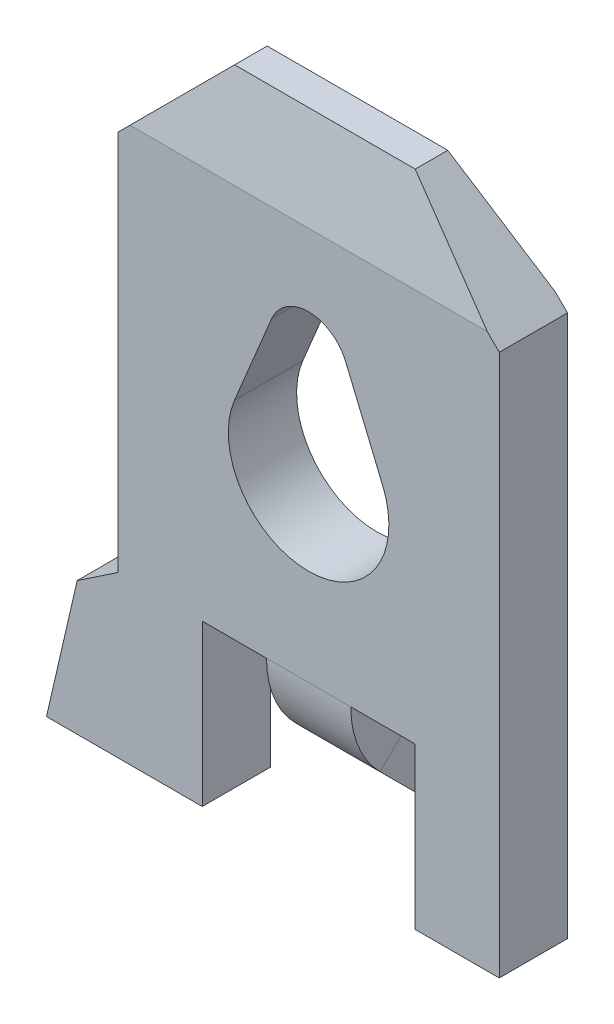
ISO-10303-21;
HEADER;
FILE_DESCRIPTION(('STEP AP214'),'2;1');
FILE_NAME('part.step','',(''),(''),'','','');
FILE_SCHEMA(('AUTOMOTIVE_DESIGN { 1 0 10303 214 1 1 1 1 }'));
ENDSEC;
DATA;
#1=APPLICATION_CONTEXT('core data for automotive mechanical design processes');
#2=APPLICATION_PROTOCOL_DEFINITION('international standard','automotive_design',2000,#1);
#3=PRODUCT_CONTEXT('',#1,'mechanical');
#4=PRODUCT('Part','Part','',(#3));
#5=PRODUCT_RELATED_PRODUCT_CATEGORY('part','',(#4));
#6=PRODUCT_DEFINITION_FORMATION('','',#4);
#7=PRODUCT_DEFINITION_CONTEXT('part definition',#1,'design');
#8=PRODUCT_DEFINITION('design','',#6,#7);
#9=PRODUCT_DEFINITION_SHAPE('','',#8);
#10=(LENGTH_UNIT() NAMED_UNIT(*) SI_UNIT(.MILLI.,.METRE.));
#11=(NAMED_UNIT(*) PLANE_ANGLE_UNIT() SI_UNIT($,.RADIAN.));
#12=(NAMED_UNIT(*) SI_UNIT($,.STERADIAN.) SOLID_ANGLE_UNIT());
#13=UNCERTAINTY_MEASURE_WITH_UNIT(LENGTH_MEASURE(1.E-05),#10,'distance_accuracy_value','');
#14=(GEOMETRIC_REPRESENTATION_CONTEXT(3) GLOBAL_UNCERTAINTY_ASSIGNED_CONTEXT((#13)) GLOBAL_UNIT_ASSIGNED_CONTEXT((#10,
#11,#12)) REPRESENTATION_CONTEXT('',''));
#15=CARTESIAN_POINT('',(0.,0.,0.));
#16=DIRECTION('',(0.,0.,1.));
#17=DIRECTION('',(1.,0.,0.));
#18=AXIS2_PLACEMENT_3D('',#15,#16,#17);
#19=CARTESIAN_POINT('',(4.75,0.149999999999999,0.));
#20=DIRECTION('',(0.,0.,1.));
#21=DIRECTION('',(0.,-1.,0.));
#22=AXIS2_PLACEMENT_3D('',#19,#20,#21);
#23=PLANE('',#22);
#24=DIRECTION('',(0.384813689288075,-0.922994271128755,0.));
#25=VECTOR('',#24,1.);
#26=CARTESIAN_POINT('',(2.84243697464802,5.82748992853653,0.));
#27=LINE('',#26,#25);
#28=CARTESIAN_POINT('',(2.84243697464802,5.82748992853653,0.));
#29=VERTEX_POINT('',#28);
#30=CARTESIAN_POINT('',(3.29799427112875,4.73481368928808,0.));
#31=VERTEX_POINT('',#30);
#32=EDGE_CURVE('E310',#29,#31,#27,.T.);
#33=ORIENTED_EDGE('',*,*,#32,.F.);
#34=CARTESIAN_POINT('',(2.375,5.65,0.));
#35=DIRECTION('',(0.,0.,1.));
#36=DIRECTION('',(0.,-1.,0.));
#37=AXIS2_PLACEMENT_3D('',#34,#35,#36);
#38=CIRCLE('',#37,0.5);
#39=CARTESIAN_POINT('',(1.91346153846154,5.84230769230769,0.));
#40=VERTEX_POINT('',#39);
#41=EDGE_CURVE('E313',#40,#29,#38,.F.);
#42=ORIENTED_EDGE('',*,*,#41,.F.);
#43=DIRECTION('',(0.384615384615385,0.923076923076923,0.));
#44=VECTOR('',#43,1.);
#45=CARTESIAN_POINT('',(1.91346153846154,5.84230769230769,0.));
#46=LINE('',#45,#44);
#47=CARTESIAN_POINT('',(1.45192307692308,4.73461538461538,0.));
#48=VERTEX_POINT('',#47);
#49=EDGE_CURVE('E315',#48,#40,#46,.T.);
#50=ORIENTED_EDGE('',*,*,#49,.F.);
#51=CARTESIAN_POINT('',(2.375,4.35,0.));
#52=DIRECTION('',(0.,0.,1.));
#53=DIRECTION('',(0.,-1.,0.));
#54=AXIS2_PLACEMENT_3D('',#51,#52,#53);
#55=CIRCLE('',#54,0.999999999999999);
#56=EDGE_CURVE('E307',#31,#48,#55,.F.);
#57=ORIENTED_EDGE('',*,*,#56,.F.);
#58=EDGE_LOOP('',(#33,#42,#50,#57));
#59=FACE_BOUND('',#58,.T.);
#60=DIRECTION('',(1.,0.,0.));
#61=VECTOR('',#60,1.);
#62=CARTESIAN_POINT('',(2.9,2.15,0.));
#63=LINE('',#62,#61);
#64=CARTESIAN_POINT('',(2.9,2.15,0.));
#65=VERTEX_POINT('',#64);
#66=CARTESIAN_POINT('',(3.7,2.15,0.));
#67=VERTEX_POINT('',#66);
#68=EDGE_CURVE('E274',#65,#67,#63,.T.);
#69=ORIENTED_EDGE('',*,*,#68,.F.);
#70=DIRECTION('',(-1.,0.,0.));
#71=VECTOR('',#70,1.);
#72=CARTESIAN_POINT('',(4.75,2.15,0.));
#73=LINE('',#72,#71);
#74=CARTESIAN_POINT('',(1.85,2.15,0.));
#75=VERTEX_POINT('',#74);
#76=EDGE_CURVE('E49',#65,#75,#73,.T.);
#77=ORIENTED_EDGE('',*,*,#76,.T.);
#78=DIRECTION('',(1.,0.,0.));
#79=VECTOR('',#78,1.);
#80=CARTESIAN_POINT('',(1.85,2.15,0.));
#81=LINE('',#80,#79);
#82=CARTESIAN_POINT('',(1.05,2.15,0.));
#83=VERTEX_POINT('',#82);
#84=EDGE_CURVE('E285',#83,#75,#81,.T.);
#85=ORIENTED_EDGE('',*,*,#84,.F.);
#86=DIRECTION('',(0.,1.,0.));
#87=VECTOR('',#86,1.);
#88=CARTESIAN_POINT('',(1.05,2.15,0.));
#89=LINE('',#88,#87);
#90=CARTESIAN_POINT('',(1.05,0.149999999999999,0.));
#91=VERTEX_POINT('',#90);
#92=EDGE_CURVE('E282',#91,#83,#89,.T.);
#93=ORIENTED_EDGE('',*,*,#92,.F.);
#94=DIRECTION('',(-1.,0.,0.));
#95=VECTOR('',#94,1.);
#96=CARTESIAN_POINT('',(4.75,0.149999999999999,0.));
#97=LINE('',#96,#95);
#98=CARTESIAN_POINT('',(-0.890356386047537,0.149999999999998,0.));
#99=VERTEX_POINT('',#98);
#100=EDGE_CURVE('E379',#91,#99,#97,.T.);
#101=ORIENTED_EDGE('',*,*,#100,.T.);
#102=DIRECTION('',(0.224692209858573,0.974429787531596,0.));
#103=VECTOR('',#102,1.);
#104=CARTESIAN_POINT('',(-0.507898340442458,1.80861785930754,0.));
#105=LINE('',#104,#103);
#106=CARTESIAN_POINT('',(-0.507898340442458,1.80861785930754,0.));
#107=VERTEX_POINT('',#106);
#108=EDGE_CURVE('E228',#99,#107,#105,.T.);
#109=ORIENTED_EDGE('',*,*,#108,.T.);
#110=DIRECTION('',(0.829945240760083,0.557844868525011,0.));
#111=VECTOR('',#110,1.);
#112=CARTESIAN_POINT('',(0.,2.15,0.));
#113=LINE('',#112,#111);
#114=CARTESIAN_POINT('',(0.,2.15,0.));
#115=VERTEX_POINT('',#114);
#116=EDGE_CURVE('E206',#107,#115,#113,.T.);
#117=ORIENTED_EDGE('',*,*,#116,.T.);
#118=DIRECTION('',(0.,1.,0.));
#119=VECTOR('',#118,1.);
#120=CARTESIAN_POINT('',(0.,0.149999999999999,0.));
#121=LINE('',#120,#119);
#122=CARTESIAN_POINT('',(0.,6.9,0.));
#123=VERTEX_POINT('',#122);
#124=EDGE_CURVE('E369',#115,#123,#121,.T.);
#125=ORIENTED_EDGE('',*,*,#124,.T.);
#126=DIRECTION('',(-0.707106781186548,-0.707106781186548,0.));
#127=VECTOR('',#126,1.);
#128=CARTESIAN_POINT('',(0.,6.9,0.));
#129=LINE('',#128,#127);
#130=CARTESIAN_POINT('',(0.15,7.05,0.));
#131=VERTEX_POINT('',#130);
#132=EDGE_CURVE('E343',#131,#123,#129,.T.);
#133=ORIENTED_EDGE('',*,*,#132,.F.);
#134=DIRECTION('',(-1.,0.,0.));
#135=VECTOR('',#134,1.);
#136=CARTESIAN_POINT('',(4.75,7.05,0.));
#137=LINE('',#136,#135);
#138=CARTESIAN_POINT('',(4.6,7.05,0.));
#139=VERTEX_POINT('',#138);
#140=EDGE_CURVE('E374',#139,#131,#137,.T.);
#141=ORIENTED_EDGE('',*,*,#140,.F.);
#142=DIRECTION('',(-0.707106781186548,0.707106781186548,0.));
#143=VECTOR('',#142,1.);
#144=CARTESIAN_POINT('',(3.5,8.15,0.));
#145=LINE('',#144,#143);
#146=CARTESIAN_POINT('',(4.75,6.9,0.));
#147=VERTEX_POINT('',#146);
#148=EDGE_CURVE('E339',#147,#139,#145,.T.);
#149=ORIENTED_EDGE('',*,*,#148,.F.);
#150=DIRECTION('',(0.,1.,0.));
#151=VECTOR('',#150,1.);
#152=CARTESIAN_POINT('',(4.75,0.149999999999999,0.));
#153=LINE('',#152,#151);
#154=CARTESIAN_POINT('',(4.75,0.149999999999999,0.));
#155=VERTEX_POINT('',#154);
#156=EDGE_CURVE('E371',#155,#147,#153,.T.);
#157=ORIENTED_EDGE('',*,*,#156,.F.);
#158=CARTESIAN_POINT('',(3.7,0.149999999999999,0.));
#159=VERTEX_POINT('',#158);
#160=EDGE_CURVE('E380',#155,#159,#97,.T.);
#161=ORIENTED_EDGE('',*,*,#160,.T.);
#162=DIRECTION('',(0.,-1.,0.));
#163=VECTOR('',#162,1.);
#164=CARTESIAN_POINT('',(3.7,2.15,0.));
#165=LINE('',#164,#163);
#166=EDGE_CURVE('E299',#67,#159,#165,.T.);
#167=ORIENTED_EDGE('',*,*,#166,.F.);
#168=EDGE_LOOP('',(#69,#77,#85,#93,#101,#109,#117,#125,#133,#141,#149,#157,#161,#167));
#169=FACE_BOUND('',#168,.T.);
#170=ADVANCED_FACE('F42',(#59,#169),#23,.F.);
#171=CARTESIAN_POINT('',(4.75,7.05,0.85));
#172=DIRECTION('',(0.,0.,-1.));
#173=DIRECTION('',(0.,1.,0.));
#174=AXIS2_PLACEMENT_3D('',#171,#172,#173);
#175=PLANE('',#174);
#176=DIRECTION('',(-0.384615384615385,-0.923076923076923,0.));
#177=VECTOR('',#176,1.);
#178=CARTESIAN_POINT('',(1.91346153846154,5.84230769230769,0.849999999999999));
#179=LINE('',#178,#177);
#180=CARTESIAN_POINT('',(1.91346153846154,5.84230769230769,0.85));
#181=VERTEX_POINT('',#180);
#182=CARTESIAN_POINT('',(1.45192307692308,4.73461538461538,0.849999999999999));
#183=VERTEX_POINT('',#182);
#184=EDGE_CURVE('E317',#181,#183,#179,.T.);
#185=ORIENTED_EDGE('',*,*,#184,.F.);
#186=CARTESIAN_POINT('',(2.375,5.65,0.849999999999999));
#187=DIRECTION('',(0.,0.,1.));
#188=DIRECTION('',(1.,0.,0.));
#189=AXIS2_PLACEMENT_3D('',#186,#187,#188);
#190=CIRCLE('',#189,0.5);
#191=CARTESIAN_POINT('',(2.84243697464802,5.82748992853653,0.849999999999999));
#192=VERTEX_POINT('',#191);
#193=EDGE_CURVE('E293',#192,#181,#190,.T.);
#194=ORIENTED_EDGE('',*,*,#193,.F.);
#195=DIRECTION('',(-0.384813689288075,0.922994271128755,0.));
#196=VECTOR('',#195,1.);
#197=CARTESIAN_POINT('',(2.84243697464802,5.82748992853653,0.849999999999999));
#198=LINE('',#197,#196);
#199=CARTESIAN_POINT('',(3.29799427112875,4.73481368928808,0.849999999999999));
#200=VERTEX_POINT('',#199);
#201=EDGE_CURVE('E323',#200,#192,#198,.T.);
#202=ORIENTED_EDGE('',*,*,#201,.F.);
#203=CARTESIAN_POINT('',(2.375,4.35,0.849999999999999));
#204=DIRECTION('',(0.,0.,1.));
#205=DIRECTION('',(1.,0.,0.));
#206=AXIS2_PLACEMENT_3D('',#203,#204,#205);
#207=CIRCLE('',#206,0.999999999999999);
#208=EDGE_CURVE('E320',#183,#200,#207,.T.);
#209=ORIENTED_EDGE('',*,*,#208,.F.);
#210=EDGE_LOOP('',(#185,#194,#202,#209));
#211=FACE_BOUND('',#210,.T.);
#212=DIRECTION('',(-1.,0.,0.));
#213=VECTOR('',#212,1.);
#214=CARTESIAN_POINT('',(1.85,2.15,0.85));
#215=LINE('',#214,#213);
#216=CARTESIAN_POINT('',(1.85,2.15,0.85));
#217=VERTEX_POINT('',#216);
#218=CARTESIAN_POINT('',(1.05,2.15,0.85));
#219=VERTEX_POINT('',#218);
#220=EDGE_CURVE('E278',#217,#219,#215,.T.);
#221=ORIENTED_EDGE('',*,*,#220,.F.);
#222=DIRECTION('',(1.,0.,0.));
#223=VECTOR('',#222,1.);
#224=CARTESIAN_POINT('',(4.75,2.15,0.849999999999999));
#225=LINE('',#224,#223);
#226=CARTESIAN_POINT('',(2.9,2.15,0.849999999999999));
#227=VERTEX_POINT('',#226);
#228=EDGE_CURVE('E396',#217,#227,#225,.T.);
#229=ORIENTED_EDGE('',*,*,#228,.T.);
#230=DIRECTION('',(-1.,0.,0.));
#231=VECTOR('',#230,1.);
#232=CARTESIAN_POINT('',(2.9,2.15,0.85));
#233=LINE('',#232,#231);
#234=CARTESIAN_POINT('',(3.7,2.15,0.85));
#235=VERTEX_POINT('',#234);
#236=EDGE_CURVE('E286',#235,#227,#233,.T.);
#237=ORIENTED_EDGE('',*,*,#236,.F.);
#238=DIRECTION('',(0.,1.,0.));
#239=VECTOR('',#238,1.);
#240=CARTESIAN_POINT('',(3.7,2.15,0.85));
#241=LINE('',#240,#239);
#242=CARTESIAN_POINT('',(3.7,0.149999999999999,0.849999999999999));
#243=VERTEX_POINT('',#242);
#244=EDGE_CURVE('E294',#243,#235,#241,.T.);
#245=ORIENTED_EDGE('',*,*,#244,.F.);
#246=DIRECTION('',(-1.,0.,0.));
#247=VECTOR('',#246,1.);
#248=CARTESIAN_POINT('',(4.75,0.149999999999999,0.849999999999999));
#249=LINE('',#248,#247);
#250=CARTESIAN_POINT('',(4.75,0.149999999999999,0.849999999999999));
#251=VERTEX_POINT('',#250);
#252=EDGE_CURVE('E384',#251,#243,#249,.T.);
#253=ORIENTED_EDGE('',*,*,#252,.F.);
#254=DIRECTION('',(0.,-1.,0.));
#255=VECTOR('',#254,1.);
#256=CARTESIAN_POINT('',(4.75,7.05,0.85));
#257=LINE('',#256,#255);
#258=CARTESIAN_POINT('',(4.75,6.9,0.85));
#259=VERTEX_POINT('',#258);
#260=EDGE_CURVE('E366',#259,#251,#257,.T.);
#261=ORIENTED_EDGE('',*,*,#260,.F.);
#262=DIRECTION('',(0.707106781186548,-0.707106781186548,0.));
#263=VECTOR('',#262,1.);
#264=CARTESIAN_POINT('',(3.5,8.15,0.849999999999999));
#265=LINE('',#264,#263);
#266=CARTESIAN_POINT('',(4.6,7.05,0.849999999999999));
#267=VERTEX_POINT('',#266);
#268=EDGE_CURVE('E335',#267,#259,#265,.T.);
#269=ORIENTED_EDGE('',*,*,#268,.F.);
#270=DIRECTION('',(-1.,0.,0.));
#271=VECTOR('',#270,1.);
#272=CARTESIAN_POINT('',(4.75,7.05,0.85));
#273=LINE('',#272,#271);
#274=CARTESIAN_POINT('',(0.15,7.05,0.849999999999999));
#275=VERTEX_POINT('',#274);
#276=EDGE_CURVE('E387',#267,#275,#273,.T.);
#277=ORIENTED_EDGE('',*,*,#276,.T.);
#278=DIRECTION('',(0.707106781186547,0.707106781186548,0.));
#279=VECTOR('',#278,1.);
#280=CARTESIAN_POINT('',(0.,6.9,0.849999999999999));
#281=LINE('',#280,#279);
#282=CARTESIAN_POINT('',(0.,6.9,0.849999999999999));
#283=VERTEX_POINT('',#282);
#284=EDGE_CURVE('E336',#283,#275,#281,.T.);
#285=ORIENTED_EDGE('',*,*,#284,.F.);
#286=DIRECTION('',(0.,-1.,0.));
#287=VECTOR('',#286,1.);
#288=CARTESIAN_POINT('',(0.,7.05,0.85));
#289=LINE('',#288,#287);
#290=CARTESIAN_POINT('',(0.,2.15,0.849999999999999));
#291=VERTEX_POINT('',#290);
#292=EDGE_CURVE('E225',#283,#291,#289,.T.);
#293=ORIENTED_EDGE('',*,*,#292,.T.);
#294=DIRECTION('',(-0.829945240760083,-0.557844868525011,0.));
#295=VECTOR('',#294,1.);
#296=CARTESIAN_POINT('',(0.,2.15,0.849999999999999));
#297=LINE('',#296,#295);
#298=CARTESIAN_POINT('',(-0.507898340442458,1.80861785930754,0.849999999999999));
#299=VERTEX_POINT('',#298);
#300=EDGE_CURVE('E56',#291,#299,#297,.T.);
#301=ORIENTED_EDGE('',*,*,#300,.T.);
#302=DIRECTION('',(-0.224692209858573,-0.974429787531596,0.));
#303=VECTOR('',#302,1.);
#304=CARTESIAN_POINT('',(-0.507898340442458,1.80861785930754,0.849999999999999));
#305=LINE('',#304,#303);
#306=CARTESIAN_POINT('',(-0.890356386047537,0.149999999999998,0.849999999999999));
#307=VERTEX_POINT('',#306);
#308=EDGE_CURVE('E214',#299,#307,#305,.T.);
#309=ORIENTED_EDGE('',*,*,#308,.T.);
#310=CARTESIAN_POINT('',(1.05,0.149999999999999,0.849999999999999));
#311=VERTEX_POINT('',#310);
#312=EDGE_CURVE('E383',#311,#307,#249,.T.);
#313=ORIENTED_EDGE('',*,*,#312,.F.);
#314=DIRECTION('',(0.,-1.,0.));
#315=VECTOR('',#314,1.);
#316=CARTESIAN_POINT('',(1.05,2.15,0.85));
#317=LINE('',#316,#315);
#318=EDGE_CURVE('E280',#219,#311,#317,.T.);
#319=ORIENTED_EDGE('',*,*,#318,.F.);
#320=EDGE_LOOP('',(#221,#229,#237,#245,#253,#261,#269,#277,#285,#293,#301,#309,#313,#319));
#321=FACE_BOUND('',#320,.T.);
#322=ADVANCED_FACE('F222',(#211,#321),#175,.F.);
#323=CARTESIAN_POINT('',(4.75,0.149999999999999,0.));
#324=DIRECTION('',(0.,1.,0.));
#325=DIRECTION('',(0.,0.,1.));
#326=AXIS2_PLACEMENT_3D('',#323,#324,#325);
#327=PLANE('',#326);
#328=ORIENTED_EDGE('',*,*,#100,.F.);
#329=DIRECTION('',(0.,0.,-1.));
#330=VECTOR('',#329,1.);
#331=CARTESIAN_POINT('',(1.05,0.149999999999999,3.0040659228538));
#332=LINE('',#331,#330);
#333=EDGE_CURVE('E289',#311,#91,#332,.T.);
#334=ORIENTED_EDGE('',*,*,#333,.F.);
#335=ORIENTED_EDGE('',*,*,#312,.T.);
#336=DIRECTION('',(0.,0.,1.));
#337=VECTOR('',#336,1.);
#338=CARTESIAN_POINT('',(-0.890356386047537,0.149999999999998,-2.18923148483107));
#339=LINE('',#338,#337);
#340=EDGE_CURVE('E209',#99,#307,#339,.T.);
#341=ORIENTED_EDGE('',*,*,#340,.F.);
#342=EDGE_LOOP('',(#328,#334,#335,#341));
#343=FACE_BOUND('',#342,.T.);
#344=ADVANCED_FACE('F454',(#343),#327,.F.);
#345=CARTESIAN_POINT('',(4.75,7.05,0.));
#346=DIRECTION('',(0.,-0.214348018272916,0.976757353216485));
#347=DIRECTION('',(0.,-0.976757353216485,-0.214348018272916));
#348=AXIS2_PLACEMENT_3D('',#345,#346,#347);
#349=PLANE('',#348);
#350=ORIENTED_EDGE('',*,*,#140,.T.);
#351=DIRECTION('',(0.698744344369524,0.698744344369524,0.153338457091523));
#352=VECTOR('',#351,1.);
#353=CARTESIAN_POINT('',(2.39592083042662,9.29592083042662,0.492864146468432));
#354=LINE('',#353,#352);
#355=CARTESIAN_POINT('',(1.25,8.15,0.241393442622949));
#356=VERTEX_POINT('',#355);
#357=EDGE_CURVE('E357',#131,#356,#354,.T.);
#358=ORIENTED_EDGE('',*,*,#357,.T.);
#359=DIRECTION('',(-1.,0.,0.));
#360=VECTOR('',#359,1.);
#361=CARTESIAN_POINT('',(4.75,8.15,0.241393442622949));
#362=LINE('',#361,#360);
#363=CARTESIAN_POINT('',(3.5,8.15,0.241393442622949));
#364=VERTEX_POINT('',#363);
#365=EDGE_CURVE('E393',#364,#356,#362,.T.);
#366=ORIENTED_EDGE('',*,*,#365,.F.);
#367=DIRECTION('',(0.698744344369524,-0.698744344369524,-0.153338457091523));
#368=VECTOR('',#367,1.);
#369=CARTESIAN_POINT('',(4.67323654881826,6.97676345118174,-0.0160716569500576));
#370=LINE('',#369,#368);
#371=EDGE_CURVE('E363',#364,#139,#370,.T.);
#372=ORIENTED_EDGE('',*,*,#371,.T.);
#373=EDGE_LOOP('',(#350,#358,#366,#372));
#374=FACE_BOUND('',#373,.T.);
#375=ADVANCED_FACE('F516',(#374),#349,.F.);
#376=CARTESIAN_POINT('',(4.75,8.15,0.241393442622949));
#377=DIRECTION('',(0.,-1.,0.));
#378=DIRECTION('',(0.,0.,-1.));
#379=AXIS2_PLACEMENT_3D('',#376,#377,#378);
#380=PLANE('',#379);
#381=ORIENTED_EDGE('',*,*,#365,.T.);
#382=DIRECTION('',(0.,0.,1.));
#383=VECTOR('',#382,1.);
#384=CARTESIAN_POINT('',(1.25,8.15,-1.76776695296637));
#385=LINE('',#384,#383);
#386=CARTESIAN_POINT('',(1.25,8.15,0.647131147540979));
#387=VERTEX_POINT('',#386);
#388=EDGE_CURVE('E340',#356,#387,#385,.T.);
#389=ORIENTED_EDGE('',*,*,#388,.T.);
#390=DIRECTION('',(-1.,0.,0.));
#391=VECTOR('',#390,1.);
#392=CARTESIAN_POINT('',(4.75,8.15,0.647131147540979));
#393=LINE('',#392,#391);
#394=CARTESIAN_POINT('',(3.5,8.15,0.647131147540979));
#395=VERTEX_POINT('',#394);
#396=EDGE_CURVE('E390',#395,#387,#393,.T.);
#397=ORIENTED_EDGE('',*,*,#396,.F.);
#398=DIRECTION('',(0.,0.,1.));
#399=VECTOR('',#398,1.);
#400=CARTESIAN_POINT('',(3.5,8.15,-1.76776695296637));
#401=LINE('',#400,#399);
#402=EDGE_CURVE('E349',#364,#395,#401,.T.);
#403=ORIENTED_EDGE('',*,*,#402,.F.);
#404=EDGE_LOOP('',(#381,#389,#397,#403));
#405=FACE_BOUND('',#404,.T.);
#406=ADVANCED_FACE('F512',(#405),#380,.F.);
#407=CARTESIAN_POINT('',(4.75,8.15,0.647131147540979));
#408=DIRECTION('',(0.,-0.181367589437408,-0.983415373838371));
#409=DIRECTION('',(0.,0.983415373838371,-0.181367589437408));
#410=AXIS2_PLACEMENT_3D('',#407,#408,#409);
#411=PLANE('',#410);
#412=ORIENTED_EDGE('',*,*,#396,.T.);
#413=DIRECTION('',(-0.70116968993079,-0.70116968993079,0.12931408215937));
#414=VECTOR('',#413,1.);
#415=CARTESIAN_POINT('',(2.97073626927174,9.87073626927174,0.329782245421185));
#416=LINE('',#415,#414);
#417=EDGE_CURVE('E347',#387,#275,#416,.T.);
#418=ORIENTED_EDGE('',*,*,#417,.T.);
#419=ORIENTED_EDGE('',*,*,#276,.F.);
#420=DIRECTION('',(-0.70116968993079,0.70116968993079,-0.12931408215937));
#421=VECTOR('',#420,1.);
#422=CARTESIAN_POINT('',(4.11454866759705,7.53545133240295,0.760470041155192));
#423=LINE('',#422,#421);
#424=EDGE_CURVE('E360',#267,#395,#423,.T.);
#425=ORIENTED_EDGE('',*,*,#424,.T.);
#426=EDGE_LOOP('',(#412,#418,#419,#425));
#427=FACE_BOUND('',#426,.T.);
#428=ADVANCED_FACE('F508',(#427),#411,.F.);
#429=ORIENTED_EDGE('',*,*,#252,.T.);
#430=DIRECTION('',(0.,0.,-1.));
#431=VECTOR('',#430,1.);
#432=CARTESIAN_POINT('',(3.7,0.149999999999999,3.0040659228538));
#433=LINE('',#432,#431);
#434=EDGE_CURVE('E296',#243,#159,#433,.T.);
#435=ORIENTED_EDGE('',*,*,#434,.T.);
#436=ORIENTED_EDGE('',*,*,#160,.F.);
#437=DIRECTION('',(0.,0.,-1.));
#438=VECTOR('',#437,1.);
#439=CARTESIAN_POINT('',(4.75,0.149999999999999,0.));
#440=LINE('',#439,#438);
#441=EDGE_CURVE('E368',#251,#155,#440,.T.);
#442=ORIENTED_EDGE('',*,*,#441,.F.);
#443=EDGE_LOOP('',(#429,#435,#436,#442));
#444=FACE_BOUND('',#443,.T.);
#445=ADVANCED_FACE('F501',(#444),#327,.F.);
#446=CARTESIAN_POINT('',(4.75,0.,0.));
#447=DIRECTION('',(1.,0.,0.));
#448=DIRECTION('',(0.,0.,-1.));
#449=AXIS2_PLACEMENT_3D('',#446,#447,#448);
#450=PLANE('',#449);
#451=DIRECTION('',(0.,0.,1.));
#452=VECTOR('',#451,1.);
#453=CARTESIAN_POINT('',(4.75,6.9,-1.76776695296637));
#454=LINE('',#453,#452);
#455=EDGE_CURVE('E350',#147,#259,#454,.T.);
#456=ORIENTED_EDGE('',*,*,#455,.T.);
#457=ORIENTED_EDGE('',*,*,#260,.T.);
#458=ORIENTED_EDGE('',*,*,#441,.T.);
#459=ORIENTED_EDGE('',*,*,#156,.T.);
#460=EDGE_LOOP('',(#456,#457,#458,#459));
#461=FACE_BOUND('',#460,.T.);
#462=ADVANCED_FACE('F498',(#461),#450,.T.);
#463=CARTESIAN_POINT('',(0.,0.,0.));
#464=DIRECTION('',(1.,0.,0.));
#465=DIRECTION('',(0.,0.,-1.));
#466=AXIS2_PLACEMENT_3D('',#463,#464,#465);
#467=PLANE('',#466);
#468=ORIENTED_EDGE('',*,*,#124,.F.);
#469=DIRECTION('',(0.,0.,1.));
#470=VECTOR('',#469,1.);
#471=CARTESIAN_POINT('',(0.,2.15,-2.18923148483107));
#472=LINE('',#471,#470);
#473=EDGE_CURVE('E210',#115,#291,#472,.T.);
#474=ORIENTED_EDGE('',*,*,#473,.T.);
#475=ORIENTED_EDGE('',*,*,#292,.F.);
#476=DIRECTION('',(0.,0.,1.));
#477=VECTOR('',#476,1.);
#478=CARTESIAN_POINT('',(0.,6.9,-1.76776695296637));
#479=LINE('',#478,#477);
#480=EDGE_CURVE('E338',#123,#283,#479,.T.);
#481=ORIENTED_EDGE('',*,*,#480,.F.);
#482=EDGE_LOOP('',(#468,#474,#475,#481));
#483=FACE_BOUND('',#482,.T.);
#484=ADVANCED_FACE('F493',(#483),#467,.F.);
#485=CARTESIAN_POINT('',(0.,6.9,-1.76776695296637));
#486=DIRECTION('',(0.707106781186548,-0.707106781186548,0.));
#487=DIRECTION('',(0.707106781186548,0.707106781186548,0.));
#488=AXIS2_PLACEMENT_3D('',#485,#486,#487);
#489=PLANE('',#488);
#490=ORIENTED_EDGE('',*,*,#132,.T.);
#491=ORIENTED_EDGE('',*,*,#480,.T.);
#492=ORIENTED_EDGE('',*,*,#284,.T.);
#493=ORIENTED_EDGE('',*,*,#417,.F.);
#494=ORIENTED_EDGE('',*,*,#388,.F.);
#495=ORIENTED_EDGE('',*,*,#357,.F.);
#496=EDGE_LOOP('',(#490,#491,#492,#493,#494,#495));
#497=FACE_BOUND('',#496,.T.);
#498=ADVANCED_FACE('F490',(#497),#489,.F.);
#499=CARTESIAN_POINT('',(3.5,8.15,-1.76776695296637));
#500=DIRECTION('',(-0.707106781186547,-0.707106781186547,0.));
#501=DIRECTION('',(0.707106781186548,-0.707106781186548,0.));
#502=AXIS2_PLACEMENT_3D('',#499,#500,#501);
#503=PLANE('',#502);
#504=ORIENTED_EDGE('',*,*,#402,.T.);
#505=ORIENTED_EDGE('',*,*,#424,.F.);
#506=ORIENTED_EDGE('',*,*,#268,.T.);
#507=ORIENTED_EDGE('',*,*,#455,.F.);
#508=ORIENTED_EDGE('',*,*,#148,.T.);
#509=ORIENTED_EDGE('',*,*,#371,.F.);
#510=EDGE_LOOP('',(#504,#505,#506,#507,#508,#509));
#511=FACE_BOUND('',#510,.T.);
#512=ADVANCED_FACE('F489',(#511),#503,.F.);
#513=CARTESIAN_POINT('',(2.375,5.65,-3.44093010681705));
#514=DIRECTION('',(0.,0.,1.));
#515=DIRECTION('',(1.,0.,0.));
#516=AXIS2_PLACEMENT_3D('',#513,#514,#515);
#517=CYLINDRICAL_SURFACE('',#516,0.5);
#518=ORIENTED_EDGE('',*,*,#41,.T.);
#519=DIRECTION('',(0.,0.,1.));
#520=VECTOR('',#519,1.);
#521=CARTESIAN_POINT('',(2.84243697464802,5.82748992853653,-3.44093010681705));
#522=LINE('',#521,#520);
#523=EDGE_CURVE('E311',#29,#192,#522,.T.);
#524=ORIENTED_EDGE('',*,*,#523,.T.);
#525=ORIENTED_EDGE('',*,*,#193,.T.);
#526=DIRECTION('',(0.,0.,1.));
#527=VECTOR('',#526,1.);
#528=CARTESIAN_POINT('',(1.91346153846154,5.84230769230769,-3.44093010681705));
#529=LINE('',#528,#527);
#530=EDGE_CURVE('E326',#40,#181,#529,.T.);
#531=ORIENTED_EDGE('',*,*,#530,.F.);
#532=EDGE_LOOP('',(#518,#524,#525,#531));
#533=FACE_BOUND('',#532,.T.);
#534=ADVANCED_FACE('F472',(#533),#517,.F.);
#535=CARTESIAN_POINT('',(2.84243697464802,5.82748992853653,-3.44093010681705));
#536=DIRECTION('',(0.922994271128755,0.384813689288075,0.));
#537=DIRECTION('',(-0.384813689288075,0.922994271128755,0.));
#538=AXIS2_PLACEMENT_3D('',#535,#536,#537);
#539=PLANE('',#538);
#540=ORIENTED_EDGE('',*,*,#32,.T.);
#541=DIRECTION('',(0.,0.,1.));
#542=VECTOR('',#541,1.);
#543=CARTESIAN_POINT('',(3.29799427112875,4.73481368928808,-3.44093010681705));
#544=LINE('',#543,#542);
#545=EDGE_CURVE('E328',#31,#200,#544,.T.);
#546=ORIENTED_EDGE('',*,*,#545,.T.);
#547=ORIENTED_EDGE('',*,*,#201,.T.);
#548=ORIENTED_EDGE('',*,*,#523,.F.);
#549=EDGE_LOOP('',(#540,#546,#547,#548));
#550=FACE_BOUND('',#549,.T.);
#551=ADVANCED_FACE('F463',(#550),#539,.F.);
#552=CARTESIAN_POINT('',(2.375,4.35,-3.44093010681705));
#553=DIRECTION('',(0.,0.,1.));
#554=DIRECTION('',(1.,0.,0.));
#555=AXIS2_PLACEMENT_3D('',#552,#553,#554);
#556=CYLINDRICAL_SURFACE('',#555,0.999999999999999);
#557=ORIENTED_EDGE('',*,*,#56,.T.);
#558=DIRECTION('',(0.,0.,1.));
#559=VECTOR('',#558,1.);
#560=CARTESIAN_POINT('',(1.45192307692308,4.73461538461538,-3.44093010681705));
#561=LINE('',#560,#559);
#562=EDGE_CURVE('E330',#48,#183,#561,.T.);
#563=ORIENTED_EDGE('',*,*,#562,.T.);
#564=ORIENTED_EDGE('',*,*,#208,.T.);
#565=ORIENTED_EDGE('',*,*,#545,.F.);
#566=EDGE_LOOP('',(#557,#563,#564,#565));
#567=FACE_BOUND('',#566,.T.);
#568=ADVANCED_FACE('F465',(#567),#556,.F.);
#569=CARTESIAN_POINT('',(1.91346153846154,5.84230769230769,-3.44093010681705));
#570=DIRECTION('',(-0.923076923076923,0.384615384615385,0.));
#571=DIRECTION('',(-0.384615384615385,-0.923076923076923,0.));
#572=AXIS2_PLACEMENT_3D('',#569,#570,#571);
#573=PLANE('',#572);
#574=ORIENTED_EDGE('',*,*,#49,.T.);
#575=ORIENTED_EDGE('',*,*,#530,.T.);
#576=ORIENTED_EDGE('',*,*,#184,.T.);
#577=ORIENTED_EDGE('',*,*,#562,.F.);
#578=EDGE_LOOP('',(#574,#575,#576,#577));
#579=FACE_BOUND('',#578,.T.);
#580=ADVANCED_FACE('F474',(#579),#573,.F.);
#581=CARTESIAN_POINT('',(3.7,2.15,3.0040659228538));
#582=DIRECTION('',(1.,0.,0.));
#583=DIRECTION('',(0.,1.,0.));
#584=AXIS2_PLACEMENT_3D('',#581,#582,#583);
#585=PLANE('',#584);
#586=ORIENTED_EDGE('',*,*,#244,.T.);
#587=DIRECTION('',(0.,0.,-1.));
#588=VECTOR('',#587,1.);
#589=CARTESIAN_POINT('',(3.7,2.15,3.0040659228538));
#590=LINE('',#589,#588);
#591=EDGE_CURVE('E301',#235,#67,#590,.T.);
#592=ORIENTED_EDGE('',*,*,#591,.T.);
#593=ORIENTED_EDGE('',*,*,#166,.T.);
#594=ORIENTED_EDGE('',*,*,#434,.F.);
#595=EDGE_LOOP('',(#586,#592,#593,#594));
#596=FACE_BOUND('',#595,.T.);
#597=ADVANCED_FACE('F476',(#596),#585,.F.);
#598=CARTESIAN_POINT('',(2.9,2.15,3.0040659228538));
#599=DIRECTION('',(0.,1.,0.));
#600=DIRECTION('',(-1.,0.,0.));
#601=AXIS2_PLACEMENT_3D('',#598,#599,#600);
#602=PLANE('',#601);
#603=ORIENTED_EDGE('',*,*,#236,.T.);
#604=DIRECTION('',(0.,0.,-1.));
#605=VECTOR('',#604,1.);
#606=CARTESIAN_POINT('',(2.9,2.15,3.0040659228538));
#607=LINE('',#606,#605);
#608=EDGE_CURVE('E12',#227,#65,#607,.T.);
#609=ORIENTED_EDGE('',*,*,#608,.T.);
#610=ORIENTED_EDGE('',*,*,#68,.T.);
#611=ORIENTED_EDGE('',*,*,#591,.F.);
#612=EDGE_LOOP('',(#603,#609,#610,#611));
#613=FACE_BOUND('',#612,.T.);
#614=ADVANCED_FACE('F407',(#613),#602,.F.);
#615=CARTESIAN_POINT('',(1.85,2.15,3.0040659228538));
#616=DIRECTION('',(0.,1.,0.));
#617=DIRECTION('',(0.,0.,1.));
#618=AXIS2_PLACEMENT_3D('',#615,#616,#617);
#619=PLANE('',#618);
#620=ORIENTED_EDGE('',*,*,#220,.T.);
#621=DIRECTION('',(0.,0.,-1.));
#622=VECTOR('',#621,1.);
#623=CARTESIAN_POINT('',(1.05,2.15,3.0040659228538));
#624=LINE('',#623,#622);
#625=EDGE_CURVE('E281',#219,#83,#624,.T.);
#626=ORIENTED_EDGE('',*,*,#625,.T.);
#627=ORIENTED_EDGE('',*,*,#84,.T.);
#628=DIRECTION('',(0.,0.,-1.));
#629=VECTOR('',#628,1.);
#630=CARTESIAN_POINT('',(1.85,2.15,3.0040659228538));
#631=LINE('',#630,#629);
#632=EDGE_CURVE('E399',#217,#75,#631,.T.);
#633=ORIENTED_EDGE('',*,*,#632,.F.);
#634=EDGE_LOOP('',(#620,#626,#627,#633));
#635=FACE_BOUND('',#634,.T.);
#636=ADVANCED_FACE('F420',(#635),#619,.F.);
#637=CARTESIAN_POINT('',(1.05,2.15,3.0040659228538));
#638=DIRECTION('',(-1.,0.,0.));
#639=DIRECTION('',(0.,-1.,0.));
#640=AXIS2_PLACEMENT_3D('',#637,#638,#639);
#641=PLANE('',#640);
#642=ORIENTED_EDGE('',*,*,#318,.T.);
#643=ORIENTED_EDGE('',*,*,#333,.T.);
#644=ORIENTED_EDGE('',*,*,#92,.T.);
#645=ORIENTED_EDGE('',*,*,#625,.F.);
#646=EDGE_LOOP('',(#642,#643,#644,#645));
#647=FACE_BOUND('',#646,.T.);
#648=ADVANCED_FACE('F542',(#647),#641,.F.);
#649=CARTESIAN_POINT('',(1.85,2.15,-0.400000000000001));
#650=DIRECTION('',(-1.,0.,0.));
#651=DIRECTION('',(0.,0.,1.));
#652=AXIS2_PLACEMENT_3D('',#649,#650,#651);
#653=PLANE('',#652);
#654=ORIENTED_EDGE('',*,*,#632,.T.);
#655=CARTESIAN_POINT('',(1.85,2.15,-0.400000000000001));
#656=DIRECTION('',(1.,0.,0.));
#657=DIRECTION('',(0.,1.,0.));
#658=AXIS2_PLACEMENT_3D('',#655,#656,#657);
#659=CIRCLE('',#658,0.4);
#660=CARTESIAN_POINT('',(1.85,1.86715728752538,-0.117157287525382));
#661=VERTEX_POINT('',#660);
#662=EDGE_CURVE('E236',#75,#661,#659,.T.);
#663=ORIENTED_EDGE('',*,*,#662,.T.);
#664=DIRECTION('',(0.,-0.707106781186554,0.707106781186541));
#665=VECTOR('',#664,1.);
#666=CARTESIAN_POINT('',(1.85,-0.257038097655978,2.00703809765595));
#667=LINE('',#666,#665);
#668=CARTESIAN_POINT('',(1.85,1.26611652351682,0.483883476483182));
#669=VERTEX_POINT('',#668);
#670=EDGE_CURVE('E256',#661,#669,#667,.T.);
#671=ORIENTED_EDGE('',*,*,#670,.T.);
#672=CARTESIAN_POINT('',(1.85,2.15,-0.400000000000001));
#673=DIRECTION('',(1.,0.,0.));
#674=DIRECTION('',(0.,0.,1.));
#675=AXIS2_PLACEMENT_3D('',#672,#673,#674);
#676=CIRCLE('',#675,1.25);
#677=EDGE_CURVE('E267',#217,#669,#676,.T.);
#678=ORIENTED_EDGE('',*,*,#677,.F.);
#679=EDGE_LOOP('',(#654,#663,#671,#678));
#680=FACE_BOUND('',#679,.T.);
#681=ADVANCED_FACE('F422',(#680),#653,.T.);
#682=CARTESIAN_POINT('',(2.9,2.15,-0.400000000000001));
#683=DIRECTION('',(1.,0.,0.));
#684=DIRECTION('',(0.,0.,-1.));
#685=AXIS2_PLACEMENT_3D('',#682,#683,#684);
#686=PLANE('',#685);
#687=DIRECTION('',(0.,0.707106781186554,-0.707106781186541));
#688=VECTOR('',#687,1.);
#689=CARTESIAN_POINT('',(2.9,-0.257038097655979,2.00703809765595));
#690=LINE('',#689,#688);
#691=CARTESIAN_POINT('',(2.9,1.26611652351682,0.483883476483185));
#692=VERTEX_POINT('',#691);
#693=CARTESIAN_POINT('',(2.9,1.86715728752538,-0.117157287525382));
#694=VERTEX_POINT('',#693);
#695=EDGE_CURVE('E262',#692,#694,#690,.T.);
#696=ORIENTED_EDGE('',*,*,#695,.T.);
#697=CARTESIAN_POINT('',(2.9,2.15,-0.400000000000001));
#698=DIRECTION('',(1.,0.,0.));
#699=DIRECTION('',(0.,1.,0.));
#700=AXIS2_PLACEMENT_3D('',#697,#698,#699);
#701=CIRCLE('',#700,0.4);
#702=EDGE_CURVE('E271',#694,#65,#701,.F.);
#703=ORIENTED_EDGE('',*,*,#702,.T.);
#704=ORIENTED_EDGE('',*,*,#608,.F.);
#705=CARTESIAN_POINT('',(2.9,2.15,-0.400000000000001));
#706=DIRECTION('',(-1.,0.,0.));
#707=DIRECTION('',(0.,0.,-1.));
#708=AXIS2_PLACEMENT_3D('',#705,#706,#707);
#709=CIRCLE('',#708,1.25);
#710=EDGE_CURVE('E270',#692,#227,#709,.T.);
#711=ORIENTED_EDGE('',*,*,#710,.F.);
#712=EDGE_LOOP('',(#696,#703,#704,#711));
#713=FACE_BOUND('',#712,.T.);
#714=ADVANCED_FACE('F411',(#713),#686,.T.);
#715=CARTESIAN_POINT('',(0.876719746353102,2.15,-0.400000000000001));
#716=DIRECTION('',(1.,0.,0.));
#717=DIRECTION('',(0.,1.,0.));
#718=AXIS2_PLACEMENT_3D('',#715,#716,#717);
#719=CYLINDRICAL_SURFACE('',#718,1.25);
#720=ORIENTED_EDGE('',*,*,#710,.T.);
#721=ORIENTED_EDGE('',*,*,#228,.F.);
#722=ORIENTED_EDGE('',*,*,#677,.T.);
#723=DIRECTION('',(1.,0.,0.));
#724=VECTOR('',#723,1.);
#725=CARTESIAN_POINT('',(4.75,1.26611652351681,0.48388347648318));
#726=LINE('',#725,#724);
#727=EDGE_CURVE('E233',#669,#692,#726,.T.);
#728=ORIENTED_EDGE('',*,*,#727,.T.);
#729=EDGE_LOOP('',(#720,#721,#722,#728));
#730=FACE_BOUND('',#729,.T.);
#731=ADVANCED_FACE('F414',(#730),#719,.T.);
#732=CARTESIAN_POINT('',(0.876719746353102,2.15,-0.400000000000001));
#733=DIRECTION('',(1.,0.,0.));
#734=DIRECTION('',(0.,1.,0.));
#735=AXIS2_PLACEMENT_3D('',#732,#733,#734);
#736=CYLINDRICAL_SURFACE('',#735,0.4);
#737=ORIENTED_EDGE('',*,*,#702,.F.);
#738=DIRECTION('',(-1.,0.,0.));
#739=VECTOR('',#738,1.);
#740=CARTESIAN_POINT('',(4.75,1.86715728752538,-0.11715728752538));
#741=LINE('',#740,#739);
#742=EDGE_CURVE('E259',#694,#661,#741,.T.);
#743=ORIENTED_EDGE('',*,*,#742,.T.);
#744=ORIENTED_EDGE('',*,*,#662,.F.);
#745=ORIENTED_EDGE('',*,*,#76,.F.);
#746=EDGE_LOOP('',(#737,#743,#744,#745));
#747=FACE_BOUND('',#746,.T.);
#748=ADVANCED_FACE('F423',(#747),#736,.F.);
#749=CARTESIAN_POINT('',(0.,0.204009246963323,-1.78030532808745));
#750=DIRECTION('',(0.,-0.707106781186546,-0.707106781186549));
#751=DIRECTION('',(0.,0.707106781186549,-0.707106781186546));
#752=AXIS2_PLACEMENT_3D('',#749,#750,#751);
#753=PLANE('',#752);
#754=DIRECTION('',(0.,-0.707106781186549,0.707106781186546));
#755=VECTOR('',#754,1.);
#756=CARTESIAN_POINT('',(2.9,0.204009246963323,-1.78030532808745));
#757=LINE('',#756,#755);
#758=CARTESIAN_POINT('',(2.9,0.204009246963323,-1.78030532808745));
#759=VERTEX_POINT('',#758);
#760=CARTESIAN_POINT('',(2.9,-0.397031517045243,-1.17926456407888));
#761=VERTEX_POINT('',#760);
#762=EDGE_CURVE('E253',#759,#761,#757,.T.);
#763=ORIENTED_EDGE('',*,*,#762,.T.);
#764=DIRECTION('',(-1.,0.,0.));
#765=VECTOR('',#764,1.);
#766=CARTESIAN_POINT('',(2.9,-0.397031517045243,-1.17926456407888));
#767=LINE('',#766,#765);
#768=CARTESIAN_POINT('',(1.85,-0.397031517045243,-1.17926456407888));
#769=VERTEX_POINT('',#768);
#770=EDGE_CURVE('E250',#761,#769,#767,.T.);
#771=ORIENTED_EDGE('',*,*,#770,.T.);
#772=DIRECTION('',(0.,0.707106781186549,-0.707106781186546));
#773=VECTOR('',#772,1.);
#774=CARTESIAN_POINT('',(1.85,-0.397031517045243,-1.17926456407888));
#775=LINE('',#774,#773);
#776=CARTESIAN_POINT('',(1.85,0.204009246963323,-1.78030532808745));
#777=VERTEX_POINT('',#776);
#778=EDGE_CURVE('E247',#769,#777,#775,.T.);
#779=ORIENTED_EDGE('',*,*,#778,.T.);
#780=DIRECTION('',(1.,0.,0.));
#781=VECTOR('',#780,1.);
#782=CARTESIAN_POINT('',(1.85,0.204009246963323,-1.78030532808745));
#783=LINE('',#782,#781);
#784=EDGE_CURVE('E244',#777,#759,#783,.T.);
#785=ORIENTED_EDGE('',*,*,#784,.T.);
#786=EDGE_LOOP('',(#763,#771,#779,#785));
#787=FACE_BOUND('',#786,.T.);
#788=ADVANCED_FACE('F438',(#787),#753,.T.);
#789=CARTESIAN_POINT('',(4.75,5.18911205432847,4.40687900729485));
#790=DIRECTION('',(0.,0.707106781186549,-0.707106781186546));
#791=DIRECTION('',(0.,0.707106781186546,0.707106781186549));
#792=AXIS2_PLACEMENT_3D('',#789,#790,#791);
#793=PLANE('',#792);
#794=ORIENTED_EDGE('',*,*,#727,.F.);
#795=DIRECTION('',(0.,0.707106781186546,0.707106781186549));
#796=VECTOR('',#795,1.);
#797=CARTESIAN_POINT('',(1.85,1.7242888265144,0.942055779480764));
#798=LINE('',#797,#796);
#799=EDGE_CURVE('E239',#769,#669,#798,.T.);
#800=ORIENTED_EDGE('',*,*,#799,.F.);
#801=ORIENTED_EDGE('',*,*,#770,.F.);
#802=DIRECTION('',(0.,-0.707106781186546,-0.707106781186549));
#803=VECTOR('',#802,1.);
#804=CARTESIAN_POINT('',(2.9,1.7242888265144,0.942055779480764));
#805=LINE('',#804,#803);
#806=EDGE_CURVE('E237',#692,#761,#805,.T.);
#807=ORIENTED_EDGE('',*,*,#806,.F.);
#808=EDGE_LOOP('',(#794,#800,#801,#807));
#809=FACE_BOUND('',#808,.T.);
#810=ADVANCED_FACE('F435',(#809),#793,.F.);
#811=CARTESIAN_POINT('',(1.85,0.201134205341611,2.46521040065354));
#812=DIRECTION('',(1.,0.,0.));
#813=DIRECTION('',(0.,0.707106781186549,-0.707106781186546));
#814=AXIS2_PLACEMENT_3D('',#811,#812,#813);
#815=PLANE('',#814);
#816=ORIENTED_EDGE('',*,*,#670,.F.);
#817=DIRECTION('',(0.,-0.707106781186546,-0.707106781186549));
#818=VECTOR('',#817,1.);
#819=CARTESIAN_POINT('',(1.85,2.32532959052296,0.3410150154722));
#820=LINE('',#819,#818);
#821=EDGE_CURVE('E242',#661,#777,#820,.T.);
#822=ORIENTED_EDGE('',*,*,#821,.T.);
#823=ORIENTED_EDGE('',*,*,#778,.F.);
#824=ORIENTED_EDGE('',*,*,#799,.T.);
#825=EDGE_LOOP('',(#816,#822,#823,#824));
#826=FACE_BOUND('',#825,.T.);
#827=ADVANCED_FACE('F440',(#826),#815,.F.);
#828=CARTESIAN_POINT('',(4.75,0.911116028149869,-1.0731985469009));
#829=DIRECTION('',(0.,-0.707106781186549,0.707106781186546));
#830=DIRECTION('',(0.,-0.707106781186546,-0.707106781186549));
#831=AXIS2_PLACEMENT_3D('',#828,#829,#830);
#832=PLANE('',#831);
#833=ORIENTED_EDGE('',*,*,#742,.F.);
#834=DIRECTION('',(0.,0.707106781186546,0.707106781186549));
#835=VECTOR('',#834,1.);
#836=CARTESIAN_POINT('',(2.9,2.32532959052296,0.3410150154722));
#837=LINE('',#836,#835);
#838=EDGE_CURVE('E234',#759,#694,#837,.T.);
#839=ORIENTED_EDGE('',*,*,#838,.F.);
#840=ORIENTED_EDGE('',*,*,#784,.F.);
#841=ORIENTED_EDGE('',*,*,#821,.F.);
#842=EDGE_LOOP('',(#833,#839,#840,#841));
#843=FACE_BOUND('',#842,.T.);
#844=ADVANCED_FACE('F426',(#843),#832,.F.);
#845=CARTESIAN_POINT('',(2.9,0.201134205341611,2.46521040065354));
#846=DIRECTION('',(-1.,0.,0.));
#847=DIRECTION('',(0.,-0.707106781186546,-0.707106781186549));
#848=AXIS2_PLACEMENT_3D('',#845,#846,#847);
#849=PLANE('',#848);
#850=ORIENTED_EDGE('',*,*,#695,.F.);
#851=ORIENTED_EDGE('',*,*,#806,.T.);
#852=ORIENTED_EDGE('',*,*,#762,.F.);
#853=ORIENTED_EDGE('',*,*,#838,.T.);
#854=EDGE_LOOP('',(#850,#851,#852,#853));
#855=FACE_BOUND('',#854,.T.);
#856=ADVANCED_FACE('F431',(#855),#849,.F.);
#857=CARTESIAN_POINT('',(-0.507898340442458,1.80861785930754,-2.18923148483107));
#858=DIRECTION('',(-0.974429787531596,0.224692209858573,0.));
#859=DIRECTION('',(-0.224692209858573,-0.974429787531596,0.));
#860=AXIS2_PLACEMENT_3D('',#857,#858,#859);
#861=PLANE('',#860);
#862=ORIENTED_EDGE('',*,*,#108,.F.);
#863=ORIENTED_EDGE('',*,*,#340,.T.);
#864=ORIENTED_EDGE('',*,*,#308,.F.);
#865=DIRECTION('',(0.,0.,1.));
#866=VECTOR('',#865,1.);
#867=CARTESIAN_POINT('',(-0.507898340442458,1.80861785930754,-2.18923148483107));
#868=LINE('',#867,#866);
#869=EDGE_CURVE('E203',#107,#299,#868,.T.);
#870=ORIENTED_EDGE('',*,*,#869,.F.);
#871=EDGE_LOOP('',(#862,#863,#864,#870));
#872=FACE_BOUND('',#871,.T.);
#873=ADVANCED_FACE('F215',(#872),#861,.T.);
#874=CARTESIAN_POINT('',(0.,2.15,-2.18923148483107));
#875=DIRECTION('',(-0.557844868525011,0.829945240760083,0.));
#876=DIRECTION('',(-0.829945240760083,-0.557844868525011,0.));
#877=AXIS2_PLACEMENT_3D('',#874,#875,#876);
#878=PLANE('',#877);
#879=ORIENTED_EDGE('',*,*,#116,.F.);
#880=ORIENTED_EDGE('',*,*,#869,.T.);
#881=ORIENTED_EDGE('',*,*,#300,.F.);
#882=ORIENTED_EDGE('',*,*,#473,.F.);
#883=EDGE_LOOP('',(#879,#880,#881,#882));
#884=FACE_BOUND('',#883,.T.);
#885=ADVANCED_FACE('F205',(#884),#878,.T.);
#886=CLOSED_SHELL('',(#170,#322,#344,#375,#406,#428,#445,#462,#484,#498,#512,#534,#551,#568,
#580,#597,#614,#636,#648,#681,#714,#731,#748,#788,#810,#827,#844,#856,#873,#885));
#887=MANIFOLD_SOLID_BREP('B2',#886);
#888=ADVANCED_BREP_SHAPE_REPRESENTATION('',(#18,#887),#14);
#889=SHAPE_DEFINITION_REPRESENTATION(#9,#888);
ENDSEC;
END-ISO-10303-21;
